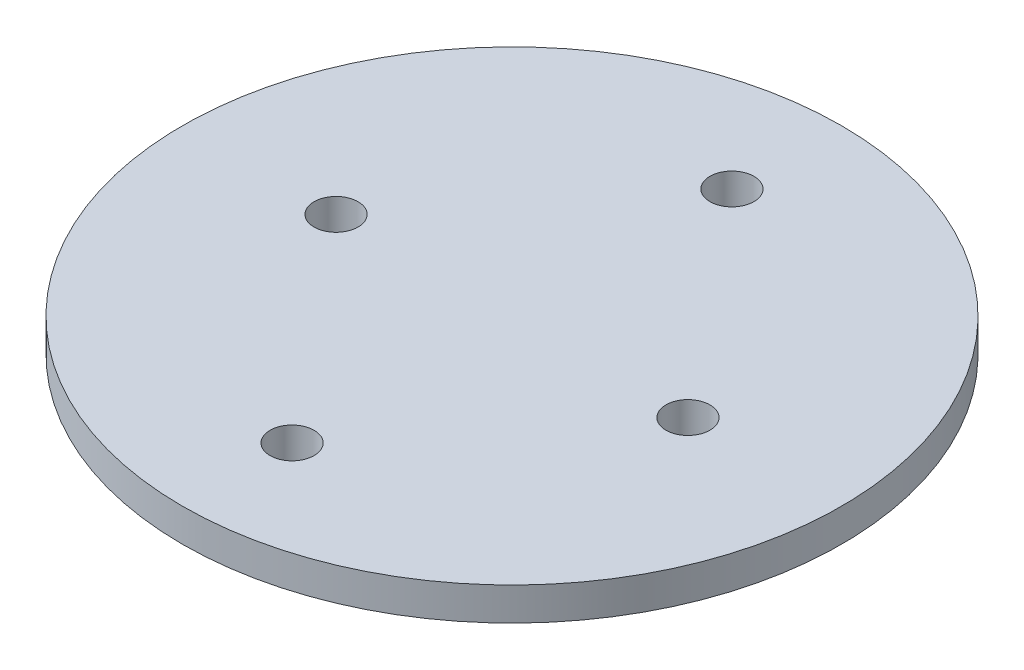
ISO-10303-21;
HEADER;
FILE_DESCRIPTION(('STEP AP214'),'2;1');
FILE_NAME('part.step','',(''),(''),'','','');
FILE_SCHEMA(('AUTOMOTIVE_DESIGN { 1 0 10303 214 1 1 1 1 }'));
ENDSEC;
DATA;
#1=APPLICATION_CONTEXT('core data for automotive mechanical design processes');
#2=APPLICATION_PROTOCOL_DEFINITION('international standard','automotive_design',2000,#1);
#3=PRODUCT_CONTEXT('',#1,'mechanical');
#4=PRODUCT('Part','Part','',(#3));
#5=PRODUCT_RELATED_PRODUCT_CATEGORY('part','',(#4));
#6=PRODUCT_DEFINITION_FORMATION('','',#4);
#7=PRODUCT_DEFINITION_CONTEXT('part definition',#1,'design');
#8=PRODUCT_DEFINITION('design','',#6,#7);
#9=PRODUCT_DEFINITION_SHAPE('','',#8);
#10=(LENGTH_UNIT() NAMED_UNIT(*) SI_UNIT(.MILLI.,.METRE.));
#11=(NAMED_UNIT(*) PLANE_ANGLE_UNIT() SI_UNIT($,.RADIAN.));
#12=(NAMED_UNIT(*) SI_UNIT($,.STERADIAN.) SOLID_ANGLE_UNIT());
#13=UNCERTAINTY_MEASURE_WITH_UNIT(LENGTH_MEASURE(1.E-05),#10,'distance_accuracy_value','');
#14=(GEOMETRIC_REPRESENTATION_CONTEXT(3) GLOBAL_UNCERTAINTY_ASSIGNED_CONTEXT((#13)) GLOBAL_UNIT_ASSIGNED_CONTEXT((#10,
#11,#12)) REPRESENTATION_CONTEXT('',''));
#15=CARTESIAN_POINT('',(0.,0.,0.));
#16=DIRECTION('',(0.,0.,1.));
#17=DIRECTION('',(1.,0.,0.));
#18=AXIS2_PLACEMENT_3D('',#15,#16,#17);
#19=CARTESIAN_POINT('',(0.,4.7625,0.));
#20=DIRECTION('',(0.,-1.,0.));
#21=DIRECTION('',(0.,0.,-1.));
#22=AXIS2_PLACEMENT_3D('',#19,#20,#21);
#23=CYLINDRICAL_SURFACE('',#22,47.575);
#24=CARTESIAN_POINT('',(0.,4.7625,0.));
#25=DIRECTION('',(0.,1.,0.));
#26=DIRECTION('',(0.,0.,1.));
#27=AXIS2_PLACEMENT_3D('',#24,#25,#26);
#28=CIRCLE('',#27,47.575);
#29=CARTESIAN_POINT('',(0.,4.7625,47.575));
#30=VERTEX_POINT('',#29);
#31=EDGE_CURVE('E11',#30,#30,#28,.T.);
#32=ORIENTED_EDGE('',*,*,#31,.F.);
#33=EDGE_LOOP('',(#32));
#34=FACE_BOUND('',#33,.T.);
#35=CARTESIAN_POINT('',(0.,0.,0.));
#36=DIRECTION('',(0.,1.,0.));
#37=DIRECTION('',(0.,0.,1.));
#38=AXIS2_PLACEMENT_3D('',#35,#36,#37);
#39=CIRCLE('',#38,47.575);
#40=CARTESIAN_POINT('',(0.,0.,47.575));
#41=VERTEX_POINT('',#40);
#42=EDGE_CURVE('E44',#41,#41,#39,.T.);
#43=ORIENTED_EDGE('',*,*,#42,.T.);
#44=EDGE_LOOP('',(#43));
#45=FACE_BOUND('',#44,.T.);
#46=ADVANCED_FACE('F41',(#34,#45),#23,.T.);
#47=CARTESIAN_POINT('',(0.,4.7625,0.));
#48=DIRECTION('',(0.,1.,0.));
#49=DIRECTION('',(0.,0.,1.));
#50=AXIS2_PLACEMENT_3D('',#47,#48,#49);
#51=PLANE('',#50);
#52=CARTESIAN_POINT('',(25.4,4.7625,0.));
#53=DIRECTION('',(0.,1.,0.));
#54=DIRECTION('',(0.,0.,1.));
#55=AXIS2_PLACEMENT_3D('',#52,#53,#54);
#56=CIRCLE('',#55,3.175);
#57=CARTESIAN_POINT('',(25.4,4.7625,3.175));
#58=VERTEX_POINT('',#57);
#59=EDGE_CURVE('E149',#58,#58,#56,.T.);
#60=ORIENTED_EDGE('',*,*,#59,.F.);
#61=EDGE_LOOP('',(#60));
#62=FACE_BOUND('',#61,.T.);
#63=CARTESIAN_POINT('',(-25.4,4.7625,0.));
#64=DIRECTION('',(0.,1.,0.));
#65=DIRECTION('',(0.,0.,1.));
#66=AXIS2_PLACEMENT_3D('',#63,#64,#65);
#67=CIRCLE('',#66,3.175);
#68=CARTESIAN_POINT('',(-25.4,4.7625,3.175));
#69=VERTEX_POINT('',#68);
#70=EDGE_CURVE('E150',#69,#69,#67,.T.);
#71=ORIENTED_EDGE('',*,*,#70,.F.);
#72=EDGE_LOOP('',(#71));
#73=FACE_BOUND('',#72,.T.);
#74=CARTESIAN_POINT('',(0.,4.7625,-31.75));
#75=DIRECTION('',(0.,1.,0.));
#76=DIRECTION('',(0.,0.,1.));
#77=AXIS2_PLACEMENT_3D('',#74,#75,#76);
#78=CIRCLE('',#77,3.175);
#79=CARTESIAN_POINT('',(0.,4.7625,-28.575));
#80=VERTEX_POINT('',#79);
#81=EDGE_CURVE('E161',#80,#80,#78,.T.);
#82=ORIENTED_EDGE('',*,*,#81,.F.);
#83=EDGE_LOOP('',(#82));
#84=FACE_BOUND('',#83,.T.);
#85=CARTESIAN_POINT('',(0.,4.7625,31.75));
#86=DIRECTION('',(0.,1.,0.));
#87=DIRECTION('',(0.,0.,1.));
#88=AXIS2_PLACEMENT_3D('',#85,#86,#87);
#89=CIRCLE('',#88,3.175);
#90=CARTESIAN_POINT('',(0.,4.7625,34.925));
#91=VERTEX_POINT('',#90);
#92=EDGE_CURVE('E54',#91,#91,#89,.T.);
#93=ORIENTED_EDGE('',*,*,#92,.F.);
#94=EDGE_LOOP('',(#93));
#95=FACE_BOUND('',#94,.T.);
#96=ORIENTED_EDGE('',*,*,#31,.T.);
#97=EDGE_LOOP('',(#96));
#98=FACE_BOUND('',#97,.T.);
#99=ADVANCED_FACE('F174',(#62,#73,#84,#95,#98),#51,.T.);
#100=CARTESIAN_POINT('',(0.,0.,0.));
#101=DIRECTION('',(0.,1.,0.));
#102=DIRECTION('',(0.,0.,1.));
#103=AXIS2_PLACEMENT_3D('',#100,#101,#102);
#104=PLANE('',#103);
#105=CARTESIAN_POINT('',(25.4,0.,0.));
#106=DIRECTION('',(0.,1.,0.));
#107=DIRECTION('',(0.,0.,1.));
#108=AXIS2_PLACEMENT_3D('',#105,#106,#107);
#109=CIRCLE('',#108,3.175);
#110=CARTESIAN_POINT('',(25.4,0.,3.175));
#111=VERTEX_POINT('',#110);
#112=EDGE_CURVE('E51',#111,#111,#109,.T.);
#113=ORIENTED_EDGE('',*,*,#112,.T.);
#114=EDGE_LOOP('',(#113));
#115=FACE_BOUND('',#114,.T.);
#116=CARTESIAN_POINT('',(-25.4,0.,0.));
#117=DIRECTION('',(0.,1.,0.));
#118=DIRECTION('',(0.,0.,1.));
#119=AXIS2_PLACEMENT_3D('',#116,#117,#118);
#120=CIRCLE('',#119,3.175);
#121=CARTESIAN_POINT('',(-25.4,0.,3.175));
#122=VERTEX_POINT('',#121);
#123=EDGE_CURVE('E144',#122,#122,#120,.T.);
#124=ORIENTED_EDGE('',*,*,#123,.T.);
#125=EDGE_LOOP('',(#124));
#126=FACE_BOUND('',#125,.T.);
#127=CARTESIAN_POINT('',(0.,0.,-31.75));
#128=DIRECTION('',(0.,1.,0.));
#129=DIRECTION('',(0.,0.,1.));
#130=AXIS2_PLACEMENT_3D('',#127,#128,#129);
#131=CIRCLE('',#130,3.175);
#132=CARTESIAN_POINT('',(0.,0.,-28.575));
#133=VERTEX_POINT('',#132);
#134=EDGE_CURVE('E154',#133,#133,#131,.T.);
#135=ORIENTED_EDGE('',*,*,#134,.T.);
#136=EDGE_LOOP('',(#135));
#137=FACE_BOUND('',#136,.T.);
#138=CARTESIAN_POINT('',(0.,0.,31.75));
#139=DIRECTION('',(0.,1.,0.));
#140=DIRECTION('',(0.,0.,1.));
#141=AXIS2_PLACEMENT_3D('',#138,#139,#140);
#142=CIRCLE('',#141,3.175);
#143=CARTESIAN_POINT('',(0.,0.,34.925));
#144=VERTEX_POINT('',#143);
#145=EDGE_CURVE('E164',#144,#144,#142,.T.);
#146=ORIENTED_EDGE('',*,*,#145,.T.);
#147=EDGE_LOOP('',(#146));
#148=FACE_BOUND('',#147,.T.);
#149=ORIENTED_EDGE('',*,*,#42,.F.);
#150=EDGE_LOOP('',(#149));
#151=FACE_BOUND('',#150,.T.);
#152=ADVANCED_FACE('F176',(#115,#126,#137,#148,#151),#104,.F.);
#153=CARTESIAN_POINT('',(0.,0.,31.75));
#154=DIRECTION('',(0.,1.,0.));
#155=DIRECTION('',(0.,0.,1.));
#156=AXIS2_PLACEMENT_3D('',#153,#154,#155);
#157=CYLINDRICAL_SURFACE('',#156,3.175);
#158=ORIENTED_EDGE('',*,*,#145,.F.);
#159=EDGE_LOOP('',(#158));
#160=FACE_BOUND('',#159,.T.);
#161=ORIENTED_EDGE('',*,*,#92,.T.);
#162=EDGE_LOOP('',(#161));
#163=FACE_BOUND('',#162,.T.);
#164=ADVANCED_FACE('F172',(#160,#163),#157,.F.);
#165=CARTESIAN_POINT('',(0.,0.,-31.75));
#166=DIRECTION('',(0.,1.,0.));
#167=DIRECTION('',(0.,0.,1.));
#168=AXIS2_PLACEMENT_3D('',#165,#166,#167);
#169=CYLINDRICAL_SURFACE('',#168,3.175);
#170=ORIENTED_EDGE('',*,*,#134,.F.);
#171=EDGE_LOOP('',(#170));
#172=FACE_BOUND('',#171,.T.);
#173=ORIENTED_EDGE('',*,*,#81,.T.);
#174=EDGE_LOOP('',(#173));
#175=FACE_BOUND('',#174,.T.);
#176=ADVANCED_FACE('F190',(#172,#175),#169,.F.);
#177=CARTESIAN_POINT('',(-25.4,0.,0.));
#178=DIRECTION('',(0.,1.,0.));
#179=DIRECTION('',(0.,0.,1.));
#180=AXIS2_PLACEMENT_3D('',#177,#178,#179);
#181=CYLINDRICAL_SURFACE('',#180,3.175);
#182=ORIENTED_EDGE('',*,*,#123,.F.);
#183=EDGE_LOOP('',(#182));
#184=FACE_BOUND('',#183,.T.);
#185=ORIENTED_EDGE('',*,*,#70,.T.);
#186=EDGE_LOOP('',(#185));
#187=FACE_BOUND('',#186,.T.);
#188=ADVANCED_FACE('F194',(#184,#187),#181,.F.);
#189=CARTESIAN_POINT('',(25.4,0.,0.));
#190=DIRECTION('',(0.,1.,0.));
#191=DIRECTION('',(0.,0.,1.));
#192=AXIS2_PLACEMENT_3D('',#189,#190,#191);
#193=CYLINDRICAL_SURFACE('',#192,3.175);
#194=ORIENTED_EDGE('',*,*,#112,.F.);
#195=EDGE_LOOP('',(#194));
#196=FACE_BOUND('',#195,.T.);
#197=ORIENTED_EDGE('',*,*,#59,.T.);
#198=EDGE_LOOP('',(#197));
#199=FACE_BOUND('',#198,.T.);
#200=ADVANCED_FACE('F198',(#196,#199),#193,.F.);
#201=CLOSED_SHELL('',(#46,#99,#152,#164,#176,#188,#200));
#202=MANIFOLD_SOLID_BREP('B2',#201);
#203=ADVANCED_BREP_SHAPE_REPRESENTATION('',(#18,#202),#14);
#204=SHAPE_DEFINITION_REPRESENTATION(#9,#203);
ENDSEC;
END-ISO-10303-21;
